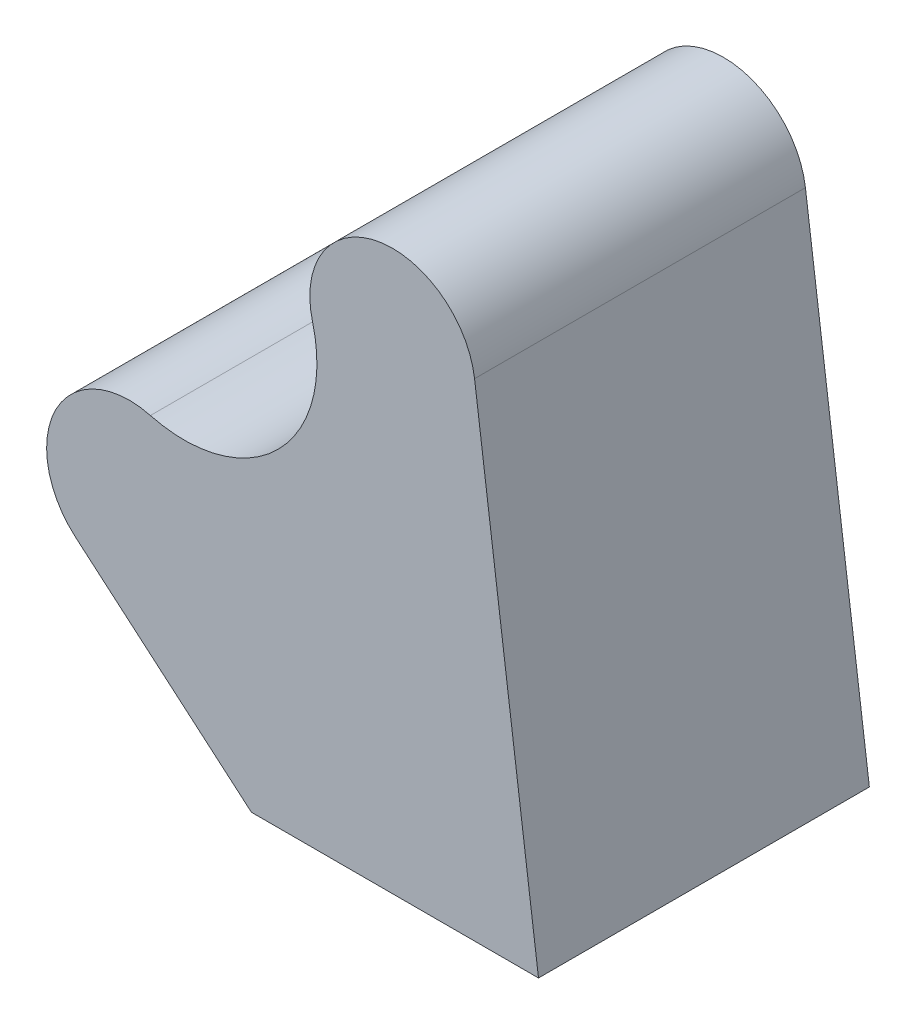
ISO-10303-21;
HEADER;
FILE_DESCRIPTION(('STEP AP214'),'2;1');
FILE_NAME('part.step','',(''),(''),'','','');
FILE_SCHEMA(('AUTOMOTIVE_DESIGN { 1 0 10303 214 1 1 1 1 }'));
ENDSEC;
DATA;
#1=APPLICATION_CONTEXT('core data for automotive mechanical design processes');
#2=APPLICATION_PROTOCOL_DEFINITION('international standard','automotive_design',2000,#1);
#3=PRODUCT_CONTEXT('',#1,'mechanical');
#4=PRODUCT('Part','Part','',(#3));
#5=PRODUCT_RELATED_PRODUCT_CATEGORY('part','',(#4));
#6=PRODUCT_DEFINITION_FORMATION('','',#4);
#7=PRODUCT_DEFINITION_CONTEXT('part definition',#1,'design');
#8=PRODUCT_DEFINITION('design','',#6,#7);
#9=PRODUCT_DEFINITION_SHAPE('','',#8);
#10=(LENGTH_UNIT() NAMED_UNIT(*) SI_UNIT(.MILLI.,.METRE.));
#11=(NAMED_UNIT(*) PLANE_ANGLE_UNIT() SI_UNIT($,.RADIAN.));
#12=(NAMED_UNIT(*) SI_UNIT($,.STERADIAN.) SOLID_ANGLE_UNIT());
#13=UNCERTAINTY_MEASURE_WITH_UNIT(LENGTH_MEASURE(1.E-05),#10,'distance_accuracy_value','');
#14=(GEOMETRIC_REPRESENTATION_CONTEXT(3) GLOBAL_UNCERTAINTY_ASSIGNED_CONTEXT((#13)) GLOBAL_UNIT_ASSIGNED_CONTEXT((#10,
#11,#12)) REPRESENTATION_CONTEXT('',''));
#15=CARTESIAN_POINT('',(0.,0.,0.));
#16=DIRECTION('',(0.,0.,1.));
#17=DIRECTION('',(1.,0.,0.));
#18=AXIS2_PLACEMENT_3D('',#15,#16,#17);
#19=CARTESIAN_POINT('',(0.,0.,40.));
#20=DIRECTION('',(0.,0.,-1.));
#21=DIRECTION('',(-1.,0.,0.));
#22=AXIS2_PLACEMENT_3D('',#19,#20,#21);
#23=CYLINDRICAL_SURFACE('',#22,10.);
#24=CARTESIAN_POINT('',(0.,0.,0.));
#25=DIRECTION('',(0.,0.,1.));
#26=DIRECTION('',(1.,0.,0.));
#27=AXIS2_PLACEMENT_3D('',#24,#25,#26);
#28=CIRCLE('',#27,10.);
#29=CARTESIAN_POINT('',(2.54553470636395,9.67058700693482,0.));
#30=VERTEX_POINT('',#29);
#31=CARTESIAN_POINT('',(-6.49649719704432,-7.60233675712904,0.));
#32=VERTEX_POINT('',#31);
#33=EDGE_CURVE('E118',#30,#32,#28,.T.);
#34=ORIENTED_EDGE('',*,*,#33,.T.);
#35=DIRECTION('',(0.,0.,-1.));
#36=VECTOR('',#35,1.);
#37=CARTESIAN_POINT('',(-6.49649719704432,-7.60233675712904,40.));
#38=LINE('',#37,#36);
#39=CARTESIAN_POINT('',(-6.49649719704432,-7.60233675712904,40.));
#40=VERTEX_POINT('',#39);
#41=EDGE_CURVE('E11',#40,#32,#38,.T.);
#42=ORIENTED_EDGE('',*,*,#41,.F.);
#43=CARTESIAN_POINT('',(0.,0.,40.));
#44=DIRECTION('',(0.,0.,1.));
#45=DIRECTION('',(1.,0.,0.));
#46=AXIS2_PLACEMENT_3D('',#43,#44,#45);
#47=CIRCLE('',#46,10.);
#48=CARTESIAN_POINT('',(2.54553470636395,9.67058700693482,40.));
#49=VERTEX_POINT('',#48);
#50=EDGE_CURVE('E128',#49,#40,#47,.T.);
#51=ORIENTED_EDGE('',*,*,#50,.F.);
#52=DIRECTION('',(0.,0.,-1.));
#53=VECTOR('',#52,1.);
#54=CARTESIAN_POINT('',(2.54553470636395,9.67058700693482,40.));
#55=LINE('',#54,#53);
#56=EDGE_CURVE('E114',#49,#30,#55,.T.);
#57=ORIENTED_EDGE('',*,*,#56,.T.);
#58=EDGE_LOOP('',(#34,#42,#51,#57));
#59=FACE_BOUND('',#58,.T.);
#60=ADVANCED_FACE('F34',(#59),#23,.T.);
#61=CARTESIAN_POINT('',(-6.49649719704432,-7.60233675712904,40.));
#62=DIRECTION('',(0.649649719704432,0.760233675712904,0.));
#63=DIRECTION('',(-0.760233675712904,0.649649719704432,0.));
#64=AXIS2_PLACEMENT_3D('',#61,#62,#63);
#65=PLANE('',#64);
#66=DIRECTION('',(0.760233675712904,-0.649649719704432,0.));
#67=VECTOR('',#66,1.);
#68=CARTESIAN_POINT('',(-6.49649719704432,-7.60233675712904,0.));
#69=LINE('',#68,#67);
#70=CARTESIAN_POINT('',(14.754187877419,-25.7618869628026,0.));
#71=VERTEX_POINT('',#70);
#72=EDGE_CURVE('E121',#32,#71,#69,.T.);
#73=ORIENTED_EDGE('',*,*,#72,.T.);
#74=DIRECTION('',(0.,0.,-1.));
#75=VECTOR('',#74,1.);
#76=CARTESIAN_POINT('',(14.754187877419,-25.7618869628026,40.));
#77=LINE('',#76,#75);
#78=CARTESIAN_POINT('',(14.754187877419,-25.7618869628026,40.));
#79=VERTEX_POINT('',#78);
#80=EDGE_CURVE('E42',#79,#71,#77,.T.);
#81=ORIENTED_EDGE('',*,*,#80,.F.);
#82=DIRECTION('',(0.760233675712904,-0.649649719704432,0.));
#83=VECTOR('',#82,1.);
#84=CARTESIAN_POINT('',(-6.49649719704432,-7.60233675712904,40.));
#85=LINE('',#84,#83);
#86=EDGE_CURVE('E87',#40,#79,#85,.T.);
#87=ORIENTED_EDGE('',*,*,#86,.F.);
#88=ORIENTED_EDGE('',*,*,#41,.T.);
#89=EDGE_LOOP('',(#73,#81,#87,#88));
#90=FACE_BOUND('',#89,.T.);
#91=ADVANCED_FACE('F152',(#90),#65,.F.);
#92=CARTESIAN_POINT('',(14.754187877419,-25.7618869628026,40.));
#93=DIRECTION('',(0.,1.,0.));
#94=DIRECTION('',(-1.,0.,0.));
#95=AXIS2_PLACEMENT_3D('',#92,#93,#94);
#96=PLANE('',#95);
#97=DIRECTION('',(1.,0.,0.));
#98=VECTOR('',#97,1.);
#99=CARTESIAN_POINT('',(14.754187877419,-25.7618869628026,0.));
#100=LINE('',#99,#98);
#101=CARTESIAN_POINT('',(49.4647248595748,-25.7618869628026,0.));
#102=VERTEX_POINT('',#101);
#103=EDGE_CURVE('E123',#71,#102,#100,.T.);
#104=ORIENTED_EDGE('',*,*,#103,.T.);
#105=DIRECTION('',(0.,0.,-1.));
#106=VECTOR('',#105,1.);
#107=CARTESIAN_POINT('',(49.4647248595748,-25.7618869628026,40.));
#108=LINE('',#107,#106);
#109=CARTESIAN_POINT('',(49.4647248595748,-25.7618869628026,40.));
#110=VERTEX_POINT('',#109);
#111=EDGE_CURVE('E109',#110,#102,#108,.T.);
#112=ORIENTED_EDGE('',*,*,#111,.F.);
#113=DIRECTION('',(1.,0.,0.));
#114=VECTOR('',#113,1.);
#115=CARTESIAN_POINT('',(14.754187877419,-25.7618869628026,40.));
#116=LINE('',#115,#114);
#117=EDGE_CURVE('E100',#79,#110,#116,.T.);
#118=ORIENTED_EDGE('',*,*,#117,.F.);
#119=ORIENTED_EDGE('',*,*,#80,.T.);
#120=EDGE_LOOP('',(#104,#112,#118,#119));
#121=FACE_BOUND('',#120,.T.);
#122=ADVANCED_FACE('F134',(#121),#96,.F.);
#123=CARTESIAN_POINT('',(49.4647248595748,-25.7618869628026,40.));
#124=DIRECTION('',(-0.991493043516046,-0.130159689071878,0.));
#125=DIRECTION('',(0.130159689071878,-0.991493043516046,0.));
#126=AXIS2_PLACEMENT_3D('',#123,#124,#125);
#127=PLANE('',#126);
#128=DIRECTION('',(-0.130159689071878,0.991493043516046,0.));
#129=VECTOR('',#128,1.);
#130=CARTESIAN_POINT('',(49.4647248595748,-25.7618869628026,0.));
#131=LINE('',#130,#129);
#132=CARTESIAN_POINT('',(41.734735588555,33.1214020441135,0.));
#133=VERTEX_POINT('',#132);
#134=EDGE_CURVE('E108',#102,#133,#131,.T.);
#135=ORIENTED_EDGE('',*,*,#134,.T.);
#136=DIRECTION('',(0.,0.,-1.));
#137=VECTOR('',#136,1.);
#138=CARTESIAN_POINT('',(41.734735588555,33.1214020441135,40.));
#139=LINE('',#138,#137);
#140=CARTESIAN_POINT('',(41.734735588555,33.1214020441135,40.));
#141=VERTEX_POINT('',#140);
#142=EDGE_CURVE('E105',#141,#133,#139,.T.);
#143=ORIENTED_EDGE('',*,*,#142,.F.);
#144=DIRECTION('',(-0.130159689071878,0.991493043516046,0.));
#145=VECTOR('',#144,1.);
#146=CARTESIAN_POINT('',(49.4647248595748,-25.7618869628026,40.));
#147=LINE('',#146,#145);
#148=EDGE_CURVE('E94',#110,#141,#147,.T.);
#149=ORIENTED_EDGE('',*,*,#148,.F.);
#150=ORIENTED_EDGE('',*,*,#111,.T.);
#151=EDGE_LOOP('',(#135,#143,#149,#150));
#152=FACE_BOUND('',#151,.T.);
#153=ADVANCED_FACE('F106',(#152),#127,.F.);
#154=CARTESIAN_POINT('',(31.8198051533946,31.8198051533947,40.));
#155=DIRECTION('',(0.,0.,-1.));
#156=DIRECTION('',(-1.,0.,0.));
#157=AXIS2_PLACEMENT_3D('',#154,#155,#156);
#158=CYLINDRICAL_SURFACE('',#157,10.);
#159=CARTESIAN_POINT('',(31.8198051533946,31.8198051533947,0.));
#160=DIRECTION('',(0.,0.,1.));
#161=DIRECTION('',(-1.,0.,0.));
#162=AXIS2_PLACEMENT_3D('',#159,#160,#161);
#163=CIRCLE('',#162,10.);
#164=CARTESIAN_POINT('',(22.1492181464598,29.2742704470307,0.));
#165=VERTEX_POINT('',#164);
#166=EDGE_CURVE('E73',#133,#165,#163,.T.);
#167=ORIENTED_EDGE('',*,*,#166,.T.);
#168=DIRECTION('',(0.,0.,-1.));
#169=VECTOR('',#168,1.);
#170=CARTESIAN_POINT('',(22.1492181464598,29.2742704470307,40.));
#171=LINE('',#170,#169);
#172=CARTESIAN_POINT('',(22.1492181464598,29.2742704470307,40.));
#173=VERTEX_POINT('',#172);
#174=EDGE_CURVE('E110',#173,#165,#171,.T.);
#175=ORIENTED_EDGE('',*,*,#174,.F.);
#176=CARTESIAN_POINT('',(31.8198051533946,31.8198051533947,40.));
#177=DIRECTION('',(0.,0.,1.));
#178=DIRECTION('',(-1.,0.,0.));
#179=AXIS2_PLACEMENT_3D('',#176,#177,#178);
#180=CIRCLE('',#179,10.);
#181=EDGE_CURVE('E98',#141,#173,#180,.T.);
#182=ORIENTED_EDGE('',*,*,#181,.F.);
#183=ORIENTED_EDGE('',*,*,#142,.T.);
#184=EDGE_LOOP('',(#167,#175,#182,#183));
#185=FACE_BOUND('',#184,.T.);
#186=ADVANCED_FACE('F112',(#185),#158,.T.);
#187=CARTESIAN_POINT('',(6.63045279579424,25.1893523576004,40.));
#188=DIRECTION('',(0.,0.,-1.));
#189=DIRECTION('',(-1.,0.,0.));
#190=AXIS2_PLACEMENT_3D('',#187,#188,#189);
#191=CYLINDRICAL_SURFACE('',#190,16.0473871333115);
#192=CARTESIAN_POINT('',(6.63045279579424,25.1893523576004,0.));
#193=DIRECTION('',(0.,0.,-1.));
#194=DIRECTION('',(1.,0.,0.));
#195=AXIS2_PLACEMENT_3D('',#192,#193,#194);
#196=CIRCLE('',#195,16.0473871333115);
#197=EDGE_CURVE('E79',#165,#30,#196,.T.);
#198=ORIENTED_EDGE('',*,*,#197,.T.);
#199=ORIENTED_EDGE('',*,*,#56,.F.);
#200=CARTESIAN_POINT('',(6.63045279579424,25.1893523576004,40.));
#201=DIRECTION('',(0.,0.,-1.));
#202=DIRECTION('',(1.,0.,0.));
#203=AXIS2_PLACEMENT_3D('',#200,#201,#202);
#204=CIRCLE('',#203,16.0473871333115);
#205=EDGE_CURVE('E50',#173,#49,#204,.T.);
#206=ORIENTED_EDGE('',*,*,#205,.F.);
#207=ORIENTED_EDGE('',*,*,#174,.T.);
#208=EDGE_LOOP('',(#198,#199,#206,#207));
#209=FACE_BOUND('',#208,.T.);
#210=ADVANCED_FACE('F141',(#209),#191,.F.);
#211=CARTESIAN_POINT('',(0.,0.,40.));
#212=DIRECTION('',(0.,0.,1.));
#213=DIRECTION('',(1.,0.,0.));
#214=AXIS2_PLACEMENT_3D('',#211,#212,#213);
#215=PLANE('',#214);
#216=ORIENTED_EDGE('',*,*,#50,.T.);
#217=ORIENTED_EDGE('',*,*,#86,.T.);
#218=ORIENTED_EDGE('',*,*,#117,.T.);
#219=ORIENTED_EDGE('',*,*,#148,.T.);
#220=ORIENTED_EDGE('',*,*,#181,.T.);
#221=ORIENTED_EDGE('',*,*,#205,.T.);
#222=EDGE_LOOP('',(#216,#217,#218,#219,#220,#221));
#223=FACE_BOUND('',#222,.T.);
#224=ADVANCED_FACE('F96',(#223),#215,.T.);
#225=CARTESIAN_POINT('',(0.,0.,0.));
#226=DIRECTION('',(0.,0.,1.));
#227=DIRECTION('',(1.,0.,0.));
#228=AXIS2_PLACEMENT_3D('',#225,#226,#227);
#229=PLANE('',#228);
#230=ORIENTED_EDGE('',*,*,#33,.F.);
#231=ORIENTED_EDGE('',*,*,#197,.F.);
#232=ORIENTED_EDGE('',*,*,#166,.F.);
#233=ORIENTED_EDGE('',*,*,#134,.F.);
#234=ORIENTED_EDGE('',*,*,#103,.F.);
#235=ORIENTED_EDGE('',*,*,#72,.F.);
#236=EDGE_LOOP('',(#230,#231,#232,#233,#234,#235));
#237=FACE_BOUND('',#236,.T.);
#238=ADVANCED_FACE('F137',(#237),#229,.F.);
#239=CLOSED_SHELL('',(#60,#91,#122,#153,#186,#210,#224,#238));
#240=MANIFOLD_SOLID_BREP('B2',#239);
#241=ADVANCED_BREP_SHAPE_REPRESENTATION('',(#18,#240),#14);
#242=SHAPE_DEFINITION_REPRESENTATION(#9,#241);
ENDSEC;
END-ISO-10303-21;
